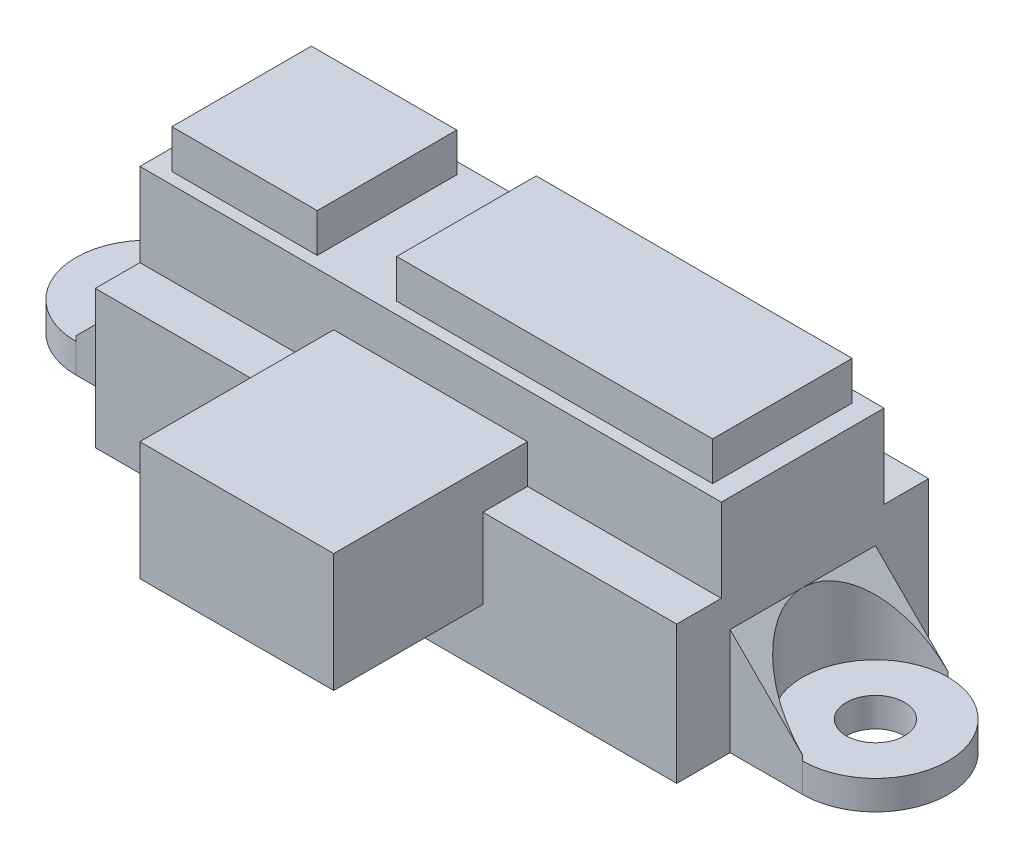
ISO-10303-21;
HEADER;
FILE_DESCRIPTION(('STEP AP214'),'2;1');
FILE_NAME('part.step','',(''),(''),'','','');
FILE_SCHEMA(('AUTOMOTIVE_DESIGN { 1 0 10303 214 1 1 1 1 }'));
ENDSEC;
DATA;
#1=APPLICATION_CONTEXT('core data for automotive mechanical design processes');
#2=APPLICATION_PROTOCOL_DEFINITION('international standard','automotive_design',2000,#1);
#3=PRODUCT_CONTEXT('',#1,'mechanical');
#4=PRODUCT('Part','Part','',(#3));
#5=PRODUCT_RELATED_PRODUCT_CATEGORY('part','',(#4));
#6=PRODUCT_DEFINITION_FORMATION('','',#4);
#7=PRODUCT_DEFINITION_CONTEXT('part definition',#1,'design');
#8=PRODUCT_DEFINITION('design','',#6,#7);
#9=PRODUCT_DEFINITION_SHAPE('','',#8);
#10=(LENGTH_UNIT() NAMED_UNIT(*) SI_UNIT(.MILLI.,.METRE.));
#11=(NAMED_UNIT(*) PLANE_ANGLE_UNIT() SI_UNIT($,.RADIAN.));
#12=(NAMED_UNIT(*) SI_UNIT($,.STERADIAN.) SOLID_ANGLE_UNIT());
#13=UNCERTAINTY_MEASURE_WITH_UNIT(LENGTH_MEASURE(1.E-05),#10,'distance_accuracy_value','');
#14=(GEOMETRIC_REPRESENTATION_CONTEXT(3) GLOBAL_UNCERTAINTY_ASSIGNED_CONTEXT((#13)) GLOBAL_UNIT_ASSIGNED_CONTEXT((#10,
#11,#12)) REPRESENTATION_CONTEXT('',''));
#15=CARTESIAN_POINT('',(0.,0.,0.));
#16=DIRECTION('',(0.,0.,1.));
#17=DIRECTION('',(1.,0.,0.));
#18=AXIS2_PLACEMENT_3D('',#15,#16,#17);
#19=CARTESIAN_POINT('',(0.,7.12,0.));
#20=DIRECTION('',(0.,1.,0.));
#21=DIRECTION('',(0.,0.,1.));
#22=AXIS2_PLACEMENT_3D('',#19,#20,#21);
#23=PLANE('',#22);
#24=DIRECTION('',(1.,0.,0.));
#25=VECTOR('',#24,1.);
#26=CARTESIAN_POINT('',(-15.,7.12,4.2));
#27=LINE('',#26,#25);
#28=CARTESIAN_POINT('',(5.,7.12,4.2));
#29=VERTEX_POINT('',#28);
#30=CARTESIAN_POINT('',(15.,7.12,4.2));
#31=VERTEX_POINT('',#30);
#32=EDGE_CURVE('E408',#29,#31,#27,.T.);
#33=ORIENTED_EDGE('',*,*,#32,.F.);
#34=DIRECTION('',(0.,0.,1.));
#35=VECTOR('',#34,1.);
#36=CARTESIAN_POINT('',(5.,7.12,0.));
#37=LINE('',#36,#35);
#38=CARTESIAN_POINT('',(5.,7.12,6.5));
#39=VERTEX_POINT('',#38);
#40=EDGE_CURVE('E288',#29,#39,#37,.T.);
#41=ORIENTED_EDGE('',*,*,#40,.T.);
#42=DIRECTION('',(1.,0.,0.));
#43=VECTOR('',#42,1.);
#44=CARTESIAN_POINT('',(-15.,7.12,6.5));
#45=LINE('',#44,#43);
#46=CARTESIAN_POINT('',(15.,7.12,6.5));
#47=VERTEX_POINT('',#46);
#48=EDGE_CURVE('E485',#39,#47,#45,.T.);
#49=ORIENTED_EDGE('',*,*,#48,.T.);
#50=DIRECTION('',(0.,0.,-1.));
#51=VECTOR('',#50,1.);
#52=CARTESIAN_POINT('',(15.,7.12,-6.5));
#53=LINE('',#52,#51);
#54=EDGE_CURVE('E476',#47,#31,#53,.T.);
#55=ORIENTED_EDGE('',*,*,#54,.T.);
#56=EDGE_LOOP('',(#33,#41,#49,#55));
#57=FACE_BOUND('',#56,.T.);
#58=ADVANCED_FACE('F40',(#57),#23,.T.);
#59=CARTESIAN_POINT('',(-15.,7.12,6.5));
#60=VERTEX_POINT('',#59);
#61=CARTESIAN_POINT('',(-5.,7.12,6.5));
#62=VERTEX_POINT('',#61);
#63=EDGE_CURVE('E486',#60,#62,#45,.T.);
#64=ORIENTED_EDGE('',*,*,#63,.T.);
#65=DIRECTION('',(0.,0.,-1.));
#66=VECTOR('',#65,1.);
#67=CARTESIAN_POINT('',(-5.,7.12,0.));
#68=LINE('',#67,#66);
#69=CARTESIAN_POINT('',(-5.,7.12,4.2));
#70=VERTEX_POINT('',#69);
#71=EDGE_CURVE('E279',#62,#70,#68,.T.);
#72=ORIENTED_EDGE('',*,*,#71,.T.);
#73=CARTESIAN_POINT('',(-15.,7.12,4.2));
#74=VERTEX_POINT('',#73);
#75=EDGE_CURVE('E399',#74,#70,#27,.T.);
#76=ORIENTED_EDGE('',*,*,#75,.F.);
#77=DIRECTION('',(0.,0.,1.));
#78=VECTOR('',#77,1.);
#79=CARTESIAN_POINT('',(-15.,7.12,-6.5));
#80=LINE('',#79,#78);
#81=EDGE_CURVE('E482',#74,#60,#80,.T.);
#82=ORIENTED_EDGE('',*,*,#81,.T.);
#83=EDGE_LOOP('',(#64,#72,#76,#82));
#84=FACE_BOUND('',#83,.T.);
#85=ADVANCED_FACE('F596',(#84),#23,.T.);
#86=CARTESIAN_POINT('',(-15.,7.12,6.5));
#87=DIRECTION('',(0.,0.,-1.));
#88=DIRECTION('',(-1.,0.,0.));
#89=AXIS2_PLACEMENT_3D('',#86,#87,#88);
#90=PLANE('',#89);
#91=DIRECTION('',(0.,1.,0.));
#92=VECTOR('',#91,1.);
#93=CARTESIAN_POINT('',(5.,7.12,6.5));
#94=LINE('',#93,#92);
#95=CARTESIAN_POINT('',(5.,3.,6.5));
#96=VERTEX_POINT('',#95);
#97=EDGE_CURVE('E55',#96,#39,#94,.T.);
#98=ORIENTED_EDGE('',*,*,#97,.F.);
#99=DIRECTION('',(1.,0.,0.));
#100=VECTOR('',#99,1.);
#101=CARTESIAN_POINT('',(-15.,3.,6.5));
#102=LINE('',#101,#100);
#103=CARTESIAN_POINT('',(-5.,3.,6.5));
#104=VERTEX_POINT('',#103);
#105=EDGE_CURVE('E11',#104,#96,#102,.T.);
#106=ORIENTED_EDGE('',*,*,#105,.F.);
#107=DIRECTION('',(0.,-1.,0.));
#108=VECTOR('',#107,1.);
#109=CARTESIAN_POINT('',(-5.,7.12,6.5));
#110=LINE('',#109,#108);
#111=EDGE_CURVE('E277',#62,#104,#110,.T.);
#112=ORIENTED_EDGE('',*,*,#111,.F.);
#113=ORIENTED_EDGE('',*,*,#63,.F.);
#114=DIRECTION('',(0.,-1.,0.));
#115=VECTOR('',#114,1.);
#116=CARTESIAN_POINT('',(-15.,7.12,6.5));
#117=LINE('',#116,#115);
#118=CARTESIAN_POINT('',(-15.,0.,6.5));
#119=VERTEX_POINT('',#118);
#120=EDGE_CURVE('E503',#60,#119,#117,.T.);
#121=ORIENTED_EDGE('',*,*,#120,.T.);
#122=DIRECTION('',(1.,0.,0.));
#123=VECTOR('',#122,1.);
#124=CARTESIAN_POINT('',(-15.,0.,6.5));
#125=LINE('',#124,#123);
#126=CARTESIAN_POINT('',(15.,0.,6.5));
#127=VERTEX_POINT('',#126);
#128=EDGE_CURVE('E499',#119,#127,#125,.T.);
#129=ORIENTED_EDGE('',*,*,#128,.T.);
#130=DIRECTION('',(0.,-1.,0.));
#131=VECTOR('',#130,1.);
#132=CARTESIAN_POINT('',(15.,7.12,6.5));
#133=LINE('',#132,#131);
#134=EDGE_CURVE('E489',#47,#127,#133,.T.);
#135=ORIENTED_EDGE('',*,*,#134,.F.);
#136=ORIENTED_EDGE('',*,*,#48,.F.);
#137=EDGE_LOOP('',(#98,#106,#112,#113,#121,#129,#135,#136));
#138=FACE_BOUND('',#137,.T.);
#139=ADVANCED_FACE('F601',(#138),#90,.F.);
#140=CARTESIAN_POINT('',(-15.,11.42,4.2));
#141=DIRECTION('',(0.,0.,-1.));
#142=DIRECTION('',(-1.,0.,0.));
#143=AXIS2_PLACEMENT_3D('',#140,#141,#142);
#144=PLANE('',#143);
#145=DIRECTION('',(0.,1.,0.));
#146=VECTOR('',#145,1.);
#147=CARTESIAN_POINT('',(5.,11.42,4.2));
#148=LINE('',#147,#146);
#149=CARTESIAN_POINT('',(5.,9.12,4.2));
#150=VERTEX_POINT('',#149);
#151=EDGE_CURVE('E48',#29,#150,#148,.T.);
#152=ORIENTED_EDGE('',*,*,#151,.F.);
#153=ORIENTED_EDGE('',*,*,#32,.T.);
#154=DIRECTION('',(0.,-1.,0.));
#155=VECTOR('',#154,1.);
#156=CARTESIAN_POINT('',(15.,11.42,4.2));
#157=LINE('',#156,#155);
#158=CARTESIAN_POINT('',(15.,11.42,4.2));
#159=VERTEX_POINT('',#158);
#160=EDGE_CURVE('E405',#159,#31,#157,.T.);
#161=ORIENTED_EDGE('',*,*,#160,.F.);
#162=DIRECTION('',(1.,0.,0.));
#163=VECTOR('',#162,1.);
#164=CARTESIAN_POINT('',(-15.,11.42,4.2));
#165=LINE('',#164,#163);
#166=CARTESIAN_POINT('',(-15.,11.42,4.2));
#167=VERTEX_POINT('',#166);
#168=EDGE_CURVE('E403',#167,#159,#165,.T.);
#169=ORIENTED_EDGE('',*,*,#168,.F.);
#170=DIRECTION('',(0.,-1.,0.));
#171=VECTOR('',#170,1.);
#172=CARTESIAN_POINT('',(-15.,11.42,4.2));
#173=LINE('',#172,#171);
#174=EDGE_CURVE('E412',#167,#74,#173,.T.);
#175=ORIENTED_EDGE('',*,*,#174,.T.);
#176=ORIENTED_EDGE('',*,*,#75,.T.);
#177=DIRECTION('',(0.,-1.,0.));
#178=VECTOR('',#177,1.);
#179=CARTESIAN_POINT('',(-5.,9.12,4.2));
#180=LINE('',#179,#178);
#181=CARTESIAN_POINT('',(-5.,9.12,4.2));
#182=VERTEX_POINT('',#181);
#183=EDGE_CURVE('E272',#182,#70,#180,.T.);
#184=ORIENTED_EDGE('',*,*,#183,.F.);
#185=DIRECTION('',(-1.,0.,0.));
#186=VECTOR('',#185,1.);
#187=CARTESIAN_POINT('',(-5.,9.12,4.2));
#188=LINE('',#187,#186);
#189=EDGE_CURVE('E680',#150,#182,#188,.T.);
#190=ORIENTED_EDGE('',*,*,#189,.F.);
#191=EDGE_LOOP('',(#152,#153,#161,#169,#175,#176,#184,#190));
#192=FACE_BOUND('',#191,.T.);
#193=ADVANCED_FACE('F550',(#192),#144,.F.);
#194=CARTESIAN_POINT('',(15.,7.12,-6.5));
#195=DIRECTION('',(-1.,0.,0.));
#196=DIRECTION('',(0.,0.,1.));
#197=AXIS2_PLACEMENT_3D('',#194,#195,#196);
#198=PLANE('',#197);
#199=DIRECTION('',(0.,-1.,0.));
#200=VECTOR('',#199,1.);
#201=CARTESIAN_POINT('',(15.,1.5,3.75));
#202=LINE('',#201,#200);
#203=CARTESIAN_POINT('',(15.,5.5,3.75));
#204=VERTEX_POINT('',#203);
#205=CARTESIAN_POINT('',(15.,0.,3.75));
#206=VERTEX_POINT('',#205);
#207=EDGE_CURVE('E473',#204,#206,#202,.T.);
#208=ORIENTED_EDGE('',*,*,#207,.F.);
#209=DIRECTION('',(0.,0.,1.));
#210=VECTOR('',#209,1.);
#211=CARTESIAN_POINT('',(15.,5.5,0.));
#212=LINE('',#211,#210);
#213=CARTESIAN_POINT('',(15.,5.5,0.));
#214=VERTEX_POINT('',#213);
#215=EDGE_CURVE('E308',#214,#204,#212,.T.);
#216=ORIENTED_EDGE('',*,*,#215,.F.);
#217=DIRECTION('',(0.,0.,1.));
#218=VECTOR('',#217,1.);
#219=CARTESIAN_POINT('',(15.,5.5,0.));
#220=LINE('',#219,#218);
#221=CARTESIAN_POINT('',(15.,5.5,-3.75));
#222=VERTEX_POINT('',#221);
#223=EDGE_CURVE('E311',#222,#214,#220,.T.);
#224=ORIENTED_EDGE('',*,*,#223,.F.);
#225=DIRECTION('',(0.,-1.,0.));
#226=VECTOR('',#225,1.);
#227=CARTESIAN_POINT('',(15.,1.5,-3.75));
#228=LINE('',#227,#226);
#229=CARTESIAN_POINT('',(15.,0.,-3.75));
#230=VERTEX_POINT('',#229);
#231=EDGE_CURVE('E470',#222,#230,#228,.T.);
#232=ORIENTED_EDGE('',*,*,#231,.T.);
#233=DIRECTION('',(0.,0.,-1.));
#234=VECTOR('',#233,1.);
#235=CARTESIAN_POINT('',(15.,0.,-6.5));
#236=LINE('',#235,#234);
#237=CARTESIAN_POINT('',(15.,0.,-6.5));
#238=VERTEX_POINT('',#237);
#239=EDGE_CURVE('E469',#230,#238,#236,.T.);
#240=ORIENTED_EDGE('',*,*,#239,.T.);
#241=DIRECTION('',(0.,-1.,0.));
#242=VECTOR('',#241,1.);
#243=CARTESIAN_POINT('',(15.,7.12,-6.5));
#244=LINE('',#243,#242);
#245=CARTESIAN_POINT('',(15.,7.12,-6.5));
#246=VERTEX_POINT('',#245);
#247=EDGE_CURVE('E509',#246,#238,#244,.T.);
#248=ORIENTED_EDGE('',*,*,#247,.F.);
#249=CARTESIAN_POINT('',(15.,7.12,-4.2));
#250=VERTEX_POINT('',#249);
#251=EDGE_CURVE('E480',#250,#246,#53,.T.);
#252=ORIENTED_EDGE('',*,*,#251,.F.);
#253=DIRECTION('',(0.,-1.,0.));
#254=VECTOR('',#253,1.);
#255=CARTESIAN_POINT('',(15.,11.42,-4.2));
#256=LINE('',#255,#254);
#257=CARTESIAN_POINT('',(15.,11.42,-4.2));
#258=VERTEX_POINT('',#257);
#259=EDGE_CURVE('E418',#258,#250,#256,.T.);
#260=ORIENTED_EDGE('',*,*,#259,.F.);
#261=DIRECTION('',(0.,0.,-1.));
#262=VECTOR('',#261,1.);
#263=CARTESIAN_POINT('',(15.,11.42,4.2));
#264=LINE('',#263,#262);
#265=EDGE_CURVE('E395',#159,#258,#264,.T.);
#266=ORIENTED_EDGE('',*,*,#265,.F.);
#267=ORIENTED_EDGE('',*,*,#160,.T.);
#268=ORIENTED_EDGE('',*,*,#54,.F.);
#269=ORIENTED_EDGE('',*,*,#134,.T.);
#270=EDGE_CURVE('E490',#127,#206,#236,.T.);
#271=ORIENTED_EDGE('',*,*,#270,.T.);
#272=EDGE_LOOP('',(#208,#216,#224,#232,#240,#248,#252,#260,#266,#267,#268,#269,#271));
#273=FACE_BOUND('',#272,.T.);
#274=ADVANCED_FACE('F42',(#273),#198,.F.);
#275=CARTESIAN_POINT('',(-15.,7.12,-6.5));
#276=DIRECTION('',(1.,0.,0.));
#277=DIRECTION('',(0.,0.,-1.));
#278=AXIS2_PLACEMENT_3D('',#275,#276,#277);
#279=PLANE('',#278);
#280=DIRECTION('',(0.,-1.,0.));
#281=VECTOR('',#280,1.);
#282=CARTESIAN_POINT('',(-15.,1.5,-3.75));
#283=LINE('',#282,#281);
#284=CARTESIAN_POINT('',(-15.,5.5,-3.75));
#285=VERTEX_POINT('',#284);
#286=CARTESIAN_POINT('',(-15.,0.,-3.75));
#287=VERTEX_POINT('',#286);
#288=EDGE_CURVE('E431',#285,#287,#283,.T.);
#289=ORIENTED_EDGE('',*,*,#288,.F.);
#290=DIRECTION('',(0.,0.,-1.));
#291=VECTOR('',#290,1.);
#292=CARTESIAN_POINT('',(-15.,5.5,0.));
#293=LINE('',#292,#291);
#294=CARTESIAN_POINT('',(-15.,5.5,0.));
#295=VERTEX_POINT('',#294);
#296=EDGE_CURVE('E319',#295,#285,#293,.T.);
#297=ORIENTED_EDGE('',*,*,#296,.F.);
#298=DIRECTION('',(0.,0.,-1.));
#299=VECTOR('',#298,1.);
#300=CARTESIAN_POINT('',(-15.,5.5,0.));
#301=LINE('',#300,#299);
#302=CARTESIAN_POINT('',(-15.,5.5,3.75));
#303=VERTEX_POINT('',#302);
#304=EDGE_CURVE('E322',#303,#295,#301,.T.);
#305=ORIENTED_EDGE('',*,*,#304,.F.);
#306=DIRECTION('',(0.,-1.,0.));
#307=VECTOR('',#306,1.);
#308=CARTESIAN_POINT('',(-15.,1.5,3.75));
#309=LINE('',#308,#307);
#310=CARTESIAN_POINT('',(-15.,0.,3.75));
#311=VERTEX_POINT('',#310);
#312=EDGE_CURVE('E445',#303,#311,#309,.T.);
#313=ORIENTED_EDGE('',*,*,#312,.T.);
#314=DIRECTION('',(0.,0.,1.));
#315=VECTOR('',#314,1.);
#316=CARTESIAN_POINT('',(-15.,0.,-6.5));
#317=LINE('',#316,#315);
#318=EDGE_CURVE('E495',#311,#119,#317,.T.);
#319=ORIENTED_EDGE('',*,*,#318,.T.);
#320=ORIENTED_EDGE('',*,*,#120,.F.);
#321=ORIENTED_EDGE('',*,*,#81,.F.);
#322=ORIENTED_EDGE('',*,*,#174,.F.);
#323=DIRECTION('',(0.,0.,1.));
#324=VECTOR('',#323,1.);
#325=CARTESIAN_POINT('',(-15.,11.42,4.2));
#326=LINE('',#325,#324);
#327=CARTESIAN_POINT('',(-15.,11.42,-4.2));
#328=VERTEX_POINT('',#327);
#329=EDGE_CURVE('E401',#328,#167,#326,.T.);
#330=ORIENTED_EDGE('',*,*,#329,.F.);
#331=DIRECTION('',(0.,-1.,0.));
#332=VECTOR('',#331,1.);
#333=CARTESIAN_POINT('',(-15.,11.42,-4.2));
#334=LINE('',#333,#332);
#335=CARTESIAN_POINT('',(-15.,7.12,-4.2));
#336=VERTEX_POINT('',#335);
#337=EDGE_CURVE('E415',#328,#336,#334,.T.);
#338=ORIENTED_EDGE('',*,*,#337,.T.);
#339=CARTESIAN_POINT('',(-15.,7.12,-6.5));
#340=VERTEX_POINT('',#339);
#341=EDGE_CURVE('E483',#340,#336,#80,.T.);
#342=ORIENTED_EDGE('',*,*,#341,.F.);
#343=DIRECTION('',(0.,-1.,0.));
#344=VECTOR('',#343,1.);
#345=CARTESIAN_POINT('',(-15.,7.12,-6.5));
#346=LINE('',#345,#344);
#347=CARTESIAN_POINT('',(-15.,0.,-6.5));
#348=VERTEX_POINT('',#347);
#349=EDGE_CURVE('E506',#340,#348,#346,.T.);
#350=ORIENTED_EDGE('',*,*,#349,.T.);
#351=EDGE_CURVE('E496',#348,#287,#317,.T.);
#352=ORIENTED_EDGE('',*,*,#351,.T.);
#353=EDGE_LOOP('',(#289,#297,#305,#313,#319,#320,#321,#322,#330,#338,#342,#350,#352));
#354=FACE_BOUND('',#353,.T.);
#355=ADVANCED_FACE('F532',(#354),#279,.F.);
#356=CARTESIAN_POINT('',(0.,11.42,0.));
#357=DIRECTION('',(0.,-1.,0.));
#358=DIRECTION('',(0.,0.,-1.));
#359=AXIS2_PLACEMENT_3D('',#356,#357,#358);
#360=PLANE('',#359);
#361=DIRECTION('',(0.,0.,1.));
#362=VECTOR('',#361,1.);
#363=CARTESIAN_POINT('',(-13.95,11.42,3.6));
#364=LINE('',#363,#362);
#365=CARTESIAN_POINT('',(-13.95,11.42,-3.6));
#366=VERTEX_POINT('',#365);
#367=CARTESIAN_POINT('',(-13.95,11.42,3.6));
#368=VERTEX_POINT('',#367);
#369=EDGE_CURVE('E361',#366,#368,#364,.T.);
#370=ORIENTED_EDGE('',*,*,#369,.F.);
#371=DIRECTION('',(-1.,0.,0.));
#372=VECTOR('',#371,1.);
#373=CARTESIAN_POINT('',(-6.45,11.42,-3.6));
#374=LINE('',#373,#372);
#375=CARTESIAN_POINT('',(-6.45,11.42,-3.6));
#376=VERTEX_POINT('',#375);
#377=EDGE_CURVE('E366',#376,#366,#374,.T.);
#378=ORIENTED_EDGE('',*,*,#377,.F.);
#379=DIRECTION('',(0.,0.,-1.));
#380=VECTOR('',#379,1.);
#381=CARTESIAN_POINT('',(-6.45,11.42,3.6));
#382=LINE('',#381,#380);
#383=CARTESIAN_POINT('',(-6.45,11.42,3.6));
#384=VERTEX_POINT('',#383);
#385=EDGE_CURVE('E378',#384,#376,#382,.T.);
#386=ORIENTED_EDGE('',*,*,#385,.F.);
#387=DIRECTION('',(1.,0.,0.));
#388=VECTOR('',#387,1.);
#389=CARTESIAN_POINT('',(-6.45,11.42,3.6));
#390=LINE('',#389,#388);
#391=EDGE_CURVE('E375',#368,#384,#390,.T.);
#392=ORIENTED_EDGE('',*,*,#391,.F.);
#393=EDGE_LOOP('',(#370,#378,#386,#392));
#394=FACE_BOUND('',#393,.T.);
#395=ORIENTED_EDGE('',*,*,#265,.T.);
#396=DIRECTION('',(-1.,0.,0.));
#397=VECTOR('',#396,1.);
#398=CARTESIAN_POINT('',(-15.,11.42,-4.2));
#399=LINE('',#398,#397);
#400=EDGE_CURVE('E398',#258,#328,#399,.T.);
#401=ORIENTED_EDGE('',*,*,#400,.T.);
#402=ORIENTED_EDGE('',*,*,#329,.T.);
#403=ORIENTED_EDGE('',*,*,#168,.T.);
#404=EDGE_LOOP('',(#395,#401,#402,#403));
#405=FACE_BOUND('',#404,.T.);
#406=DIRECTION('',(0.,0.,-1.));
#407=VECTOR('',#406,1.);
#408=CARTESIAN_POINT('',(13.95,11.42,3.6));
#409=LINE('',#408,#407);
#410=CARTESIAN_POINT('',(13.95,11.42,3.6));
#411=VERTEX_POINT('',#410);
#412=CARTESIAN_POINT('',(13.95,11.42,-3.6));
#413=VERTEX_POINT('',#412);
#414=EDGE_CURVE('E328',#411,#413,#409,.T.);
#415=ORIENTED_EDGE('',*,*,#414,.F.);
#416=DIRECTION('',(1.,0.,0.));
#417=VECTOR('',#416,1.);
#418=CARTESIAN_POINT('',(-2.35,11.42,3.6));
#419=LINE('',#418,#417);
#420=CARTESIAN_POINT('',(-2.35,11.42,3.6));
#421=VERTEX_POINT('',#420);
#422=EDGE_CURVE('E333',#421,#411,#419,.T.);
#423=ORIENTED_EDGE('',*,*,#422,.F.);
#424=DIRECTION('',(0.,0.,1.));
#425=VECTOR('',#424,1.);
#426=CARTESIAN_POINT('',(-2.35,11.42,3.6));
#427=LINE('',#426,#425);
#428=CARTESIAN_POINT('',(-2.35,11.42,-3.6));
#429=VERTEX_POINT('',#428);
#430=EDGE_CURVE('E345',#429,#421,#427,.T.);
#431=ORIENTED_EDGE('',*,*,#430,.F.);
#432=DIRECTION('',(-1.,0.,0.));
#433=VECTOR('',#432,1.);
#434=CARTESIAN_POINT('',(-2.35,11.42,-3.6));
#435=LINE('',#434,#433);
#436=EDGE_CURVE('E342',#413,#429,#435,.T.);
#437=ORIENTED_EDGE('',*,*,#436,.F.);
#438=EDGE_LOOP('',(#415,#423,#431,#437));
#439=FACE_BOUND('',#438,.T.);
#440=ADVANCED_FACE('F545',(#394,#405,#439),#360,.F.);
#441=CARTESIAN_POINT('',(-15.,7.12,-6.5));
#442=DIRECTION('',(0.,0.,1.));
#443=DIRECTION('',(1.,0.,0.));
#444=AXIS2_PLACEMENT_3D('',#441,#442,#443);
#445=PLANE('',#444);
#446=DIRECTION('',(-1.,0.,0.));
#447=VECTOR('',#446,1.);
#448=CARTESIAN_POINT('',(-15.,0.,-6.5));
#449=LINE('',#448,#447);
#450=EDGE_CURVE('E493',#238,#348,#449,.T.);
#451=ORIENTED_EDGE('',*,*,#450,.T.);
#452=ORIENTED_EDGE('',*,*,#349,.F.);
#453=DIRECTION('',(-1.,0.,0.));
#454=VECTOR('',#453,1.);
#455=CARTESIAN_POINT('',(-15.,7.12,-6.5));
#456=LINE('',#455,#454);
#457=EDGE_CURVE('E479',#246,#340,#456,.T.);
#458=ORIENTED_EDGE('',*,*,#457,.F.);
#459=ORIENTED_EDGE('',*,*,#247,.T.);
#460=EDGE_LOOP('',(#451,#452,#458,#459));
#461=FACE_BOUND('',#460,.T.);
#462=ADVANCED_FACE('F514',(#461),#445,.F.);
#463=DIRECTION('',(-1.,0.,0.));
#464=VECTOR('',#463,1.);
#465=CARTESIAN_POINT('',(-15.,7.12,-4.2));
#466=LINE('',#465,#464);
#467=EDGE_CURVE('E394',#250,#336,#466,.T.);
#468=ORIENTED_EDGE('',*,*,#467,.F.);
#469=ORIENTED_EDGE('',*,*,#251,.T.);
#470=ORIENTED_EDGE('',*,*,#457,.T.);
#471=ORIENTED_EDGE('',*,*,#341,.T.);
#472=EDGE_LOOP('',(#468,#469,#470,#471));
#473=FACE_BOUND('',#472,.T.);
#474=ADVANCED_FACE('F538',(#473),#23,.T.);
#475=CARTESIAN_POINT('',(0.,0.,0.));
#476=DIRECTION('',(0.,1.,0.));
#477=DIRECTION('',(0.,0.,1.));
#478=AXIS2_PLACEMENT_3D('',#475,#476,#477);
#479=PLANE('',#478);
#480=ORIENTED_EDGE('',*,*,#270,.F.);
#481=ORIENTED_EDGE('',*,*,#128,.F.);
#482=ORIENTED_EDGE('',*,*,#318,.F.);
#483=DIRECTION('',(-1.,0.,0.));
#484=VECTOR('',#483,1.);
#485=CARTESIAN_POINT('',(-18.75,0.,3.75));
#486=LINE('',#485,#484);
#487=CARTESIAN_POINT('',(-18.75,0.,3.75));
#488=VERTEX_POINT('',#487);
#489=EDGE_CURVE('E435',#311,#488,#486,.T.);
#490=ORIENTED_EDGE('',*,*,#489,.T.);
#491=CARTESIAN_POINT('',(-18.75,0.,0.));
#492=DIRECTION('',(0.,-1.,0.));
#493=DIRECTION('',(0.,0.,-1.));
#494=AXIS2_PLACEMENT_3D('',#491,#492,#493);
#495=CIRCLE('',#494,3.75);
#496=CARTESIAN_POINT('',(-18.75,0.,-3.75));
#497=VERTEX_POINT('',#496);
#498=EDGE_CURVE('E432',#488,#497,#495,.T.);
#499=ORIENTED_EDGE('',*,*,#498,.T.);
#500=DIRECTION('',(1.,0.,0.));
#501=VECTOR('',#500,1.);
#502=CARTESIAN_POINT('',(-15.,0.,-3.75));
#503=LINE('',#502,#501);
#504=EDGE_CURVE('E425',#497,#287,#503,.T.);
#505=ORIENTED_EDGE('',*,*,#504,.T.);
#506=ORIENTED_EDGE('',*,*,#351,.F.);
#507=ORIENTED_EDGE('',*,*,#450,.F.);
#508=ORIENTED_EDGE('',*,*,#239,.F.);
#509=DIRECTION('',(1.,0.,0.));
#510=VECTOR('',#509,1.);
#511=CARTESIAN_POINT('',(18.75,0.,-3.75));
#512=LINE('',#511,#510);
#513=CARTESIAN_POINT('',(18.75,0.,-3.75));
#514=VERTEX_POINT('',#513);
#515=EDGE_CURVE('E459',#230,#514,#512,.T.);
#516=ORIENTED_EDGE('',*,*,#515,.T.);
#517=CARTESIAN_POINT('',(18.75,0.,0.));
#518=DIRECTION('',(0.,-1.,0.));
#519=DIRECTION('',(0.,0.,-1.));
#520=AXIS2_PLACEMENT_3D('',#517,#518,#519);
#521=CIRCLE('',#520,3.75);
#522=CARTESIAN_POINT('',(18.75,0.,3.75));
#523=VERTEX_POINT('',#522);
#524=EDGE_CURVE('E452',#514,#523,#521,.T.);
#525=ORIENTED_EDGE('',*,*,#524,.T.);
#526=DIRECTION('',(-1.,0.,0.));
#527=VECTOR('',#526,1.);
#528=CARTESIAN_POINT('',(18.75,0.,3.75));
#529=LINE('',#528,#527);
#530=EDGE_CURVE('E462',#523,#206,#529,.T.);
#531=ORIENTED_EDGE('',*,*,#530,.T.);
#532=EDGE_LOOP('',(#480,#481,#482,#490,#499,#505,#506,#507,#508,#516,#525,#531));
#533=FACE_BOUND('',#532,.T.);
#534=CARTESIAN_POINT('',(18.75,0.,0.));
#535=DIRECTION('',(0.,-1.,0.));
#536=DIRECTION('',(0.,0.,-1.));
#537=AXIS2_PLACEMENT_3D('',#534,#535,#536);
#538=CIRCLE('',#537,1.5);
#539=CARTESIAN_POINT('',(18.75,0.,-1.5));
#540=VERTEX_POINT('',#539);
#541=EDGE_CURVE('E442',#540,#540,#538,.T.);
#542=ORIENTED_EDGE('',*,*,#541,.F.);
#543=EDGE_LOOP('',(#542));
#544=FACE_BOUND('',#543,.T.);
#545=CARTESIAN_POINT('',(-18.75,0.,0.));
#546=DIRECTION('',(0.,-1.,0.));
#547=DIRECTION('',(0.,0.,-1.));
#548=AXIS2_PLACEMENT_3D('',#545,#546,#547);
#549=CIRCLE('',#548,1.5);
#550=CARTESIAN_POINT('',(-18.75,0.,-1.5));
#551=VERTEX_POINT('',#550);
#552=EDGE_CURVE('E421',#551,#551,#549,.T.);
#553=ORIENTED_EDGE('',*,*,#552,.F.);
#554=EDGE_LOOP('',(#553));
#555=FACE_BOUND('',#554,.T.);
#556=ADVANCED_FACE('F527',(#533,#544,#555),#479,.F.);
#557=CARTESIAN_POINT('',(18.75,1.5,0.));
#558=DIRECTION('',(0.,-1.,0.));
#559=DIRECTION('',(0.,0.,-1.));
#560=AXIS2_PLACEMENT_3D('',#557,#558,#559);
#561=CYLINDRICAL_SURFACE('',#560,3.75);
#562=ORIENTED_EDGE('',*,*,#524,.F.);
#563=DIRECTION('',(0.,-1.,0.));
#564=VECTOR('',#563,1.);
#565=CARTESIAN_POINT('',(18.75,1.5,-3.75));
#566=LINE('',#565,#564);
#567=CARTESIAN_POINT('',(18.75,1.5,-3.75));
#568=VERTEX_POINT('',#567);
#569=EDGE_CURVE('E467',#568,#514,#566,.T.);
#570=ORIENTED_EDGE('',*,*,#569,.F.);
#571=CARTESIAN_POINT('',(18.75,1.5,0.));
#572=DIRECTION('',(0.,-1.,0.));
#573=DIRECTION('',(0.,0.,-1.));
#574=AXIS2_PLACEMENT_3D('',#571,#572,#573);
#575=CIRCLE('',#574,3.75);
#576=CARTESIAN_POINT('',(18.75,1.5,3.75));
#577=VERTEX_POINT('',#576);
#578=EDGE_CURVE('E455',#568,#577,#575,.T.);
#579=ORIENTED_EDGE('',*,*,#578,.T.);
#580=DIRECTION('',(0.,-1.,0.));
#581=VECTOR('',#580,1.);
#582=CARTESIAN_POINT('',(18.75,1.5,3.75));
#583=LINE('',#582,#581);
#584=EDGE_CURVE('E458',#577,#523,#583,.T.);
#585=ORIENTED_EDGE('',*,*,#584,.T.);
#586=EDGE_LOOP('',(#562,#570,#579,#585));
#587=FACE_BOUND('',#586,.T.);
#588=ADVANCED_FACE('F579',(#587),#561,.T.);
#589=CARTESIAN_POINT('',(18.75,1.5,-3.75));
#590=DIRECTION('',(0.,0.,-1.));
#591=DIRECTION('',(-1.,0.,0.));
#592=AXIS2_PLACEMENT_3D('',#589,#590,#591);
#593=PLANE('',#592);
#594=DIRECTION('',(0.707106781186552,-0.707106781186544,0.));
#595=VECTOR('',#594,1.);
#596=CARTESIAN_POINT('',(15.,5.5,-3.75));
#597=LINE('',#596,#595);
#598=CARTESIAN_POINT('',(18.75,1.75000000000004,-3.75));
#599=VERTEX_POINT('',#598);
#600=EDGE_CURVE('E294',#222,#599,#597,.T.);
#601=ORIENTED_EDGE('',*,*,#600,.T.);
#602=DIRECTION('',(0.,-1.,0.));
#603=VECTOR('',#602,1.);
#604=CARTESIAN_POINT('',(18.75,5.5,-3.75));
#605=LINE('',#604,#603);
#606=EDGE_CURVE('E313',#599,#568,#605,.T.);
#607=ORIENTED_EDGE('',*,*,#606,.T.);
#608=ORIENTED_EDGE('',*,*,#569,.T.);
#609=ORIENTED_EDGE('',*,*,#515,.F.);
#610=ORIENTED_EDGE('',*,*,#231,.F.);
#611=EDGE_LOOP('',(#601,#607,#608,#609,#610));
#612=FACE_BOUND('',#611,.T.);
#613=ADVANCED_FACE('F575',(#612),#593,.T.);
#614=CARTESIAN_POINT('',(18.75,1.5,3.75));
#615=DIRECTION('',(0.,0.,1.));
#616=DIRECTION('',(1.,0.,0.));
#617=AXIS2_PLACEMENT_3D('',#614,#615,#616);
#618=PLANE('',#617);
#619=DIRECTION('',(0.707106781186551,-0.707106781186543,0.));
#620=VECTOR('',#619,1.);
#621=CARTESIAN_POINT('',(15.,5.5,3.75));
#622=LINE('',#621,#620);
#623=CARTESIAN_POINT('',(18.75,1.75000000000004,3.75));
#624=VERTEX_POINT('',#623);
#625=EDGE_CURVE('E290',#204,#624,#622,.T.);
#626=ORIENTED_EDGE('',*,*,#625,.F.);
#627=ORIENTED_EDGE('',*,*,#207,.T.);
#628=ORIENTED_EDGE('',*,*,#530,.F.);
#629=ORIENTED_EDGE('',*,*,#584,.F.);
#630=DIRECTION('',(0.,-1.,0.));
#631=VECTOR('',#630,1.);
#632=CARTESIAN_POINT('',(18.75,5.5,3.75));
#633=LINE('',#632,#631);
#634=EDGE_CURVE('E306',#624,#577,#633,.T.);
#635=ORIENTED_EDGE('',*,*,#634,.F.);
#636=EDGE_LOOP('',(#626,#627,#628,#629,#635));
#637=FACE_BOUND('',#636,.T.);
#638=ADVANCED_FACE('F561',(#637),#618,.T.);
#639=CARTESIAN_POINT('',(18.75,1.5,0.));
#640=DIRECTION('',(0.,-1.,0.));
#641=DIRECTION('',(0.,0.,-1.));
#642=AXIS2_PLACEMENT_3D('',#639,#640,#641);
#643=PLANE('',#642);
#644=CARTESIAN_POINT('',(18.75,1.5,0.));
#645=DIRECTION('',(0.,-1.,0.));
#646=DIRECTION('',(0.,0.,-1.));
#647=AXIS2_PLACEMENT_3D('',#644,#645,#646);
#648=CIRCLE('',#647,1.5);
#649=CARTESIAN_POINT('',(18.75,1.5,-1.5));
#650=VERTEX_POINT('',#649);
#651=EDGE_CURVE('E449',#650,#650,#648,.T.);
#652=ORIENTED_EDGE('',*,*,#651,.T.);
#653=EDGE_LOOP('',(#652));
#654=FACE_BOUND('',#653,.T.);
#655=CARTESIAN_POINT('',(18.75,1.5,0.));
#656=DIRECTION('',(0.,1.,0.));
#657=DIRECTION('',(0.,0.,1.));
#658=AXIS2_PLACEMENT_3D('',#655,#656,#657);
#659=CIRCLE('',#658,3.75);
#660=EDGE_CURVE('E310',#568,#577,#659,.T.);
#661=ORIENTED_EDGE('',*,*,#660,.T.);
#662=ORIENTED_EDGE('',*,*,#578,.F.);
#663=EDGE_LOOP('',(#661,#662));
#664=FACE_BOUND('',#663,.T.);
#665=ADVANCED_FACE('F581',(#654,#664),#643,.F.);
#666=CARTESIAN_POINT('',(18.75,1.5,0.));
#667=DIRECTION('',(0.,-1.,0.));
#668=DIRECTION('',(0.,0.,-1.));
#669=AXIS2_PLACEMENT_3D('',#666,#667,#668);
#670=CYLINDRICAL_SURFACE('',#669,1.5);
#671=ORIENTED_EDGE('',*,*,#651,.F.);
#672=EDGE_LOOP('',(#671));
#673=FACE_BOUND('',#672,.T.);
#674=ORIENTED_EDGE('',*,*,#541,.T.);
#675=EDGE_LOOP('',(#674));
#676=FACE_BOUND('',#675,.T.);
#677=ADVANCED_FACE('F583',(#673,#676),#670,.F.);
#678=CARTESIAN_POINT('',(-15.,1.5,-3.75));
#679=DIRECTION('',(0.,0.,-1.));
#680=DIRECTION('',(-1.,0.,0.));
#681=AXIS2_PLACEMENT_3D('',#678,#679,#680);
#682=PLANE('',#681);
#683=DIRECTION('',(0.707106781186551,0.707106781186544,0.));
#684=VECTOR('',#683,1.);
#685=CARTESIAN_POINT('',(-15.,5.5,-3.75));
#686=LINE('',#685,#684);
#687=CARTESIAN_POINT('',(-18.75,1.75000000000004,-3.75));
#688=VERTEX_POINT('',#687);
#689=EDGE_CURVE('E293',#688,#285,#686,.T.);
#690=ORIENTED_EDGE('',*,*,#689,.T.);
#691=ORIENTED_EDGE('',*,*,#288,.T.);
#692=ORIENTED_EDGE('',*,*,#504,.F.);
#693=DIRECTION('',(0.,-1.,0.));
#694=VECTOR('',#693,1.);
#695=CARTESIAN_POINT('',(-18.75,1.5,-3.75));
#696=LINE('',#695,#694);
#697=CARTESIAN_POINT('',(-18.75,1.5,-3.75));
#698=VERTEX_POINT('',#697);
#699=EDGE_CURVE('E440',#698,#497,#696,.T.);
#700=ORIENTED_EDGE('',*,*,#699,.F.);
#701=DIRECTION('',(0.,-1.,0.));
#702=VECTOR('',#701,1.);
#703=CARTESIAN_POINT('',(-18.75,5.5,-3.75));
#704=LINE('',#703,#702);
#705=EDGE_CURVE('E317',#688,#698,#704,.T.);
#706=ORIENTED_EDGE('',*,*,#705,.F.);
#707=EDGE_LOOP('',(#690,#691,#692,#700,#706));
#708=FACE_BOUND('',#707,.T.);
#709=ADVANCED_FACE('F590',(#708),#682,.T.);
#710=CARTESIAN_POINT('',(-18.75,1.5,0.));
#711=DIRECTION('',(0.,-1.,0.));
#712=DIRECTION('',(0.,0.,-1.));
#713=AXIS2_PLACEMENT_3D('',#710,#711,#712);
#714=CYLINDRICAL_SURFACE('',#713,3.75);
#715=ORIENTED_EDGE('',*,*,#498,.F.);
#716=DIRECTION('',(0.,-1.,0.));
#717=VECTOR('',#716,1.);
#718=CARTESIAN_POINT('',(-18.75,1.5,3.75));
#719=LINE('',#718,#717);
#720=CARTESIAN_POINT('',(-18.75,1.5,3.75));
#721=VERTEX_POINT('',#720);
#722=EDGE_CURVE('E443',#721,#488,#719,.T.);
#723=ORIENTED_EDGE('',*,*,#722,.F.);
#724=CARTESIAN_POINT('',(-18.75,1.5,0.));
#725=DIRECTION('',(0.,-1.,0.));
#726=DIRECTION('',(0.,0.,-1.));
#727=AXIS2_PLACEMENT_3D('',#724,#725,#726);
#728=CIRCLE('',#727,3.75);
#729=EDGE_CURVE('E428',#721,#698,#728,.T.);
#730=ORIENTED_EDGE('',*,*,#729,.T.);
#731=ORIENTED_EDGE('',*,*,#699,.T.);
#732=EDGE_LOOP('',(#715,#723,#730,#731));
#733=FACE_BOUND('',#732,.T.);
#734=ADVANCED_FACE('F640',(#733),#714,.T.);
#735=CARTESIAN_POINT('',(-18.75,1.5,3.75));
#736=DIRECTION('',(0.,0.,1.));
#737=DIRECTION('',(1.,0.,0.));
#738=AXIS2_PLACEMENT_3D('',#735,#736,#737);
#739=PLANE('',#738);
#740=DIRECTION('',(0.707106781186551,0.707106781186544,0.));
#741=VECTOR('',#740,1.);
#742=CARTESIAN_POINT('',(-15.,5.5,3.75));
#743=LINE('',#742,#741);
#744=CARTESIAN_POINT('',(-18.75,1.75000000000004,3.75));
#745=VERTEX_POINT('',#744);
#746=EDGE_CURVE('E291',#745,#303,#743,.T.);
#747=ORIENTED_EDGE('',*,*,#746,.F.);
#748=DIRECTION('',(0.,-1.,0.));
#749=VECTOR('',#748,1.);
#750=CARTESIAN_POINT('',(-18.75,5.5,3.75));
#751=LINE('',#750,#749);
#752=EDGE_CURVE('E324',#745,#721,#751,.T.);
#753=ORIENTED_EDGE('',*,*,#752,.T.);
#754=ORIENTED_EDGE('',*,*,#722,.T.);
#755=ORIENTED_EDGE('',*,*,#489,.F.);
#756=ORIENTED_EDGE('',*,*,#312,.F.);
#757=EDGE_LOOP('',(#747,#753,#754,#755,#756));
#758=FACE_BOUND('',#757,.T.);
#759=ADVANCED_FACE('F638',(#758),#739,.T.);
#760=CARTESIAN_POINT('',(-18.75,1.5,0.));
#761=DIRECTION('',(0.,-1.,0.));
#762=DIRECTION('',(0.,0.,-1.));
#763=AXIS2_PLACEMENT_3D('',#760,#761,#762);
#764=PLANE('',#763);
#765=CARTESIAN_POINT('',(-18.75,1.5,0.));
#766=DIRECTION('',(0.,-1.,0.));
#767=DIRECTION('',(0.,0.,-1.));
#768=AXIS2_PLACEMENT_3D('',#765,#766,#767);
#769=CIRCLE('',#768,1.5);
#770=CARTESIAN_POINT('',(-18.75,1.5,-1.5));
#771=VERTEX_POINT('',#770);
#772=EDGE_CURVE('E422',#771,#771,#769,.T.);
#773=ORIENTED_EDGE('',*,*,#772,.T.);
#774=EDGE_LOOP('',(#773));
#775=FACE_BOUND('',#774,.T.);
#776=CARTESIAN_POINT('',(-18.75,1.5,0.));
#777=DIRECTION('',(0.,1.,0.));
#778=DIRECTION('',(0.,0.,1.));
#779=AXIS2_PLACEMENT_3D('',#776,#777,#778);
#780=CIRCLE('',#779,3.75);
#781=EDGE_CURVE('E321',#721,#698,#780,.T.);
#782=ORIENTED_EDGE('',*,*,#781,.T.);
#783=ORIENTED_EDGE('',*,*,#729,.F.);
#784=EDGE_LOOP('',(#782,#783));
#785=FACE_BOUND('',#784,.T.);
#786=ADVANCED_FACE('F634',(#775,#785),#764,.F.);
#787=CARTESIAN_POINT('',(-18.75,1.5,0.));
#788=DIRECTION('',(0.,-1.,0.));
#789=DIRECTION('',(0.,0.,-1.));
#790=AXIS2_PLACEMENT_3D('',#787,#788,#789);
#791=CYLINDRICAL_SURFACE('',#790,1.5);
#792=ORIENTED_EDGE('',*,*,#772,.F.);
#793=EDGE_LOOP('',(#792));
#794=FACE_BOUND('',#793,.T.);
#795=ORIENTED_EDGE('',*,*,#552,.T.);
#796=EDGE_LOOP('',(#795));
#797=FACE_BOUND('',#796,.T.);
#798=ADVANCED_FACE('F631',(#794,#797),#791,.F.);
#799=CARTESIAN_POINT('',(-15.,11.42,-4.2));
#800=DIRECTION('',(0.,0.,1.));
#801=DIRECTION('',(1.,0.,0.));
#802=AXIS2_PLACEMENT_3D('',#799,#800,#801);
#803=PLANE('',#802);
#804=ORIENTED_EDGE('',*,*,#467,.T.);
#805=ORIENTED_EDGE('',*,*,#337,.F.);
#806=ORIENTED_EDGE('',*,*,#400,.F.);
#807=ORIENTED_EDGE('',*,*,#259,.T.);
#808=EDGE_LOOP('',(#804,#805,#806,#807));
#809=FACE_BOUND('',#808,.T.);
#810=ADVANCED_FACE('F540',(#809),#803,.F.);
#811=CARTESIAN_POINT('',(-13.95,13.42,3.6));
#812=DIRECTION('',(1.,0.,0.));
#813=DIRECTION('',(0.,0.,-1.));
#814=AXIS2_PLACEMENT_3D('',#811,#812,#813);
#815=PLANE('',#814);
#816=ORIENTED_EDGE('',*,*,#369,.T.);
#817=DIRECTION('',(0.,-1.,0.));
#818=VECTOR('',#817,1.);
#819=CARTESIAN_POINT('',(-13.95,13.42,3.6));
#820=LINE('',#819,#818);
#821=CARTESIAN_POINT('',(-13.95,13.42,3.6));
#822=VERTEX_POINT('',#821);
#823=EDGE_CURVE('E391',#822,#368,#820,.T.);
#824=ORIENTED_EDGE('',*,*,#823,.F.);
#825=DIRECTION('',(0.,0.,1.));
#826=VECTOR('',#825,1.);
#827=CARTESIAN_POINT('',(-13.95,13.42,3.6));
#828=LINE('',#827,#826);
#829=CARTESIAN_POINT('',(-13.95,13.42,-3.6));
#830=VERTEX_POINT('',#829);
#831=EDGE_CURVE('E362',#830,#822,#828,.T.);
#832=ORIENTED_EDGE('',*,*,#831,.F.);
#833=DIRECTION('',(0.,-1.,0.));
#834=VECTOR('',#833,1.);
#835=CARTESIAN_POINT('',(-13.95,13.42,-3.6));
#836=LINE('',#835,#834);
#837=EDGE_CURVE('E372',#830,#366,#836,.T.);
#838=ORIENTED_EDGE('',*,*,#837,.T.);
#839=EDGE_LOOP('',(#816,#824,#832,#838));
#840=FACE_BOUND('',#839,.T.);
#841=ADVANCED_FACE('F630',(#840),#815,.F.);
#842=CARTESIAN_POINT('',(-6.45,13.42,3.6));
#843=DIRECTION('',(0.,0.,-1.));
#844=DIRECTION('',(-1.,0.,0.));
#845=AXIS2_PLACEMENT_3D('',#842,#843,#844);
#846=PLANE('',#845);
#847=ORIENTED_EDGE('',*,*,#391,.T.);
#848=DIRECTION('',(0.,-1.,0.));
#849=VECTOR('',#848,1.);
#850=CARTESIAN_POINT('',(-6.45,13.42,3.6));
#851=LINE('',#850,#849);
#852=CARTESIAN_POINT('',(-6.45,13.42,3.6));
#853=VERTEX_POINT('',#852);
#854=EDGE_CURVE('E388',#853,#384,#851,.T.);
#855=ORIENTED_EDGE('',*,*,#854,.F.);
#856=DIRECTION('',(1.,0.,0.));
#857=VECTOR('',#856,1.);
#858=CARTESIAN_POINT('',(-6.45,13.42,3.6));
#859=LINE('',#858,#857);
#860=EDGE_CURVE('E365',#822,#853,#859,.T.);
#861=ORIENTED_EDGE('',*,*,#860,.F.);
#862=ORIENTED_EDGE('',*,*,#823,.T.);
#863=EDGE_LOOP('',(#847,#855,#861,#862));
#864=FACE_BOUND('',#863,.T.);
#865=ADVANCED_FACE('F741',(#864),#846,.F.);
#866=CARTESIAN_POINT('',(-6.45,13.42,3.6));
#867=DIRECTION('',(-1.,0.,0.));
#868=DIRECTION('',(0.,0.,1.));
#869=AXIS2_PLACEMENT_3D('',#866,#867,#868);
#870=PLANE('',#869);
#871=ORIENTED_EDGE('',*,*,#385,.T.);
#872=DIRECTION('',(0.,-1.,0.));
#873=VECTOR('',#872,1.);
#874=CARTESIAN_POINT('',(-6.45,13.42,-3.6));
#875=LINE('',#874,#873);
#876=CARTESIAN_POINT('',(-6.45,13.42,-3.6));
#877=VERTEX_POINT('',#876);
#878=EDGE_CURVE('E385',#877,#376,#875,.T.);
#879=ORIENTED_EDGE('',*,*,#878,.F.);
#880=DIRECTION('',(0.,0.,-1.));
#881=VECTOR('',#880,1.);
#882=CARTESIAN_POINT('',(-6.45,13.42,3.6));
#883=LINE('',#882,#881);
#884=EDGE_CURVE('E368',#853,#877,#883,.T.);
#885=ORIENTED_EDGE('',*,*,#884,.F.);
#886=ORIENTED_EDGE('',*,*,#854,.T.);
#887=EDGE_LOOP('',(#871,#879,#885,#886));
#888=FACE_BOUND('',#887,.T.);
#889=ADVANCED_FACE('F737',(#888),#870,.F.);
#890=CARTESIAN_POINT('',(-6.45,13.42,-3.6));
#891=DIRECTION('',(0.,0.,1.));
#892=DIRECTION('',(1.,0.,0.));
#893=AXIS2_PLACEMENT_3D('',#890,#891,#892);
#894=PLANE('',#893);
#895=ORIENTED_EDGE('',*,*,#377,.T.);
#896=ORIENTED_EDGE('',*,*,#837,.F.);
#897=DIRECTION('',(-1.,0.,0.));
#898=VECTOR('',#897,1.);
#899=CARTESIAN_POINT('',(-6.45,13.42,-3.6));
#900=LINE('',#899,#898);
#901=EDGE_CURVE('E370',#877,#830,#900,.T.);
#902=ORIENTED_EDGE('',*,*,#901,.F.);
#903=ORIENTED_EDGE('',*,*,#878,.T.);
#904=EDGE_LOOP('',(#895,#896,#902,#903));
#905=FACE_BOUND('',#904,.T.);
#906=ADVANCED_FACE('F733',(#905),#894,.F.);
#907=CARTESIAN_POINT('',(0.,13.42,0.));
#908=DIRECTION('',(0.,1.,0.));
#909=DIRECTION('',(0.,0.,1.));
#910=AXIS2_PLACEMENT_3D('',#907,#908,#909);
#911=PLANE('',#910);
#912=ORIENTED_EDGE('',*,*,#831,.T.);
#913=ORIENTED_EDGE('',*,*,#860,.T.);
#914=ORIENTED_EDGE('',*,*,#884,.T.);
#915=ORIENTED_EDGE('',*,*,#901,.T.);
#916=EDGE_LOOP('',(#912,#913,#914,#915));
#917=FACE_BOUND('',#916,.T.);
#918=ADVANCED_FACE('F729',(#917),#911,.T.);
#919=CARTESIAN_POINT('',(13.95,13.42,3.6));
#920=DIRECTION('',(-1.,0.,0.));
#921=DIRECTION('',(0.,0.,1.));
#922=AXIS2_PLACEMENT_3D('',#919,#920,#921);
#923=PLANE('',#922);
#924=ORIENTED_EDGE('',*,*,#414,.T.);
#925=DIRECTION('',(0.,-1.,0.));
#926=VECTOR('',#925,1.);
#927=CARTESIAN_POINT('',(13.95,13.42,-3.6));
#928=LINE('',#927,#926);
#929=CARTESIAN_POINT('',(13.95,13.42,-3.6));
#930=VERTEX_POINT('',#929);
#931=EDGE_CURVE('E358',#930,#413,#928,.T.);
#932=ORIENTED_EDGE('',*,*,#931,.F.);
#933=DIRECTION('',(0.,0.,-1.));
#934=VECTOR('',#933,1.);
#935=CARTESIAN_POINT('',(13.95,13.42,3.6));
#936=LINE('',#935,#934);
#937=CARTESIAN_POINT('',(13.95,13.42,3.6));
#938=VERTEX_POINT('',#937);
#939=EDGE_CURVE('E329',#938,#930,#936,.T.);
#940=ORIENTED_EDGE('',*,*,#939,.F.);
#941=DIRECTION('',(0.,-1.,0.));
#942=VECTOR('',#941,1.);
#943=CARTESIAN_POINT('',(13.95,13.42,3.6));
#944=LINE('',#943,#942);
#945=EDGE_CURVE('E339',#938,#411,#944,.T.);
#946=ORIENTED_EDGE('',*,*,#945,.T.);
#947=EDGE_LOOP('',(#924,#932,#940,#946));
#948=FACE_BOUND('',#947,.T.);
#949=ADVANCED_FACE('F725',(#948),#923,.F.);
#950=CARTESIAN_POINT('',(-2.35,13.42,-3.6));
#951=DIRECTION('',(0.,0.,1.));
#952=DIRECTION('',(1.,0.,0.));
#953=AXIS2_PLACEMENT_3D('',#950,#951,#952);
#954=PLANE('',#953);
#955=ORIENTED_EDGE('',*,*,#436,.T.);
#956=DIRECTION('',(0.,-1.,0.));
#957=VECTOR('',#956,1.);
#958=CARTESIAN_POINT('',(-2.35,13.42,-3.6));
#959=LINE('',#958,#957);
#960=CARTESIAN_POINT('',(-2.35,13.42,-3.6));
#961=VERTEX_POINT('',#960);
#962=EDGE_CURVE('E355',#961,#429,#959,.T.);
#963=ORIENTED_EDGE('',*,*,#962,.F.);
#964=DIRECTION('',(-1.,0.,0.));
#965=VECTOR('',#964,1.);
#966=CARTESIAN_POINT('',(-2.35,13.42,-3.6));
#967=LINE('',#966,#965);
#968=EDGE_CURVE('E332',#930,#961,#967,.T.);
#969=ORIENTED_EDGE('',*,*,#968,.F.);
#970=ORIENTED_EDGE('',*,*,#931,.T.);
#971=EDGE_LOOP('',(#955,#963,#969,#970));
#972=FACE_BOUND('',#971,.T.);
#973=ADVANCED_FACE('F721',(#972),#954,.F.);
#974=CARTESIAN_POINT('',(-2.35,13.42,3.6));
#975=DIRECTION('',(1.,0.,0.));
#976=DIRECTION('',(0.,0.,-1.));
#977=AXIS2_PLACEMENT_3D('',#974,#975,#976);
#978=PLANE('',#977);
#979=ORIENTED_EDGE('',*,*,#430,.T.);
#980=DIRECTION('',(0.,-1.,0.));
#981=VECTOR('',#980,1.);
#982=CARTESIAN_POINT('',(-2.35,13.42,3.6));
#983=LINE('',#982,#981);
#984=CARTESIAN_POINT('',(-2.35,13.42,3.6));
#985=VERTEX_POINT('',#984);
#986=EDGE_CURVE('E352',#985,#421,#983,.T.);
#987=ORIENTED_EDGE('',*,*,#986,.F.);
#988=DIRECTION('',(0.,0.,1.));
#989=VECTOR('',#988,1.);
#990=CARTESIAN_POINT('',(-2.35,13.42,3.6));
#991=LINE('',#990,#989);
#992=EDGE_CURVE('E335',#961,#985,#991,.T.);
#993=ORIENTED_EDGE('',*,*,#992,.F.);
#994=ORIENTED_EDGE('',*,*,#962,.T.);
#995=EDGE_LOOP('',(#979,#987,#993,#994));
#996=FACE_BOUND('',#995,.T.);
#997=ADVANCED_FACE('F717',(#996),#978,.F.);
#998=CARTESIAN_POINT('',(-2.35,13.42,3.6));
#999=DIRECTION('',(0.,0.,-1.));
#1000=DIRECTION('',(-1.,0.,0.));
#1001=AXIS2_PLACEMENT_3D('',#998,#999,#1000);
#1002=PLANE('',#1001);
#1003=ORIENTED_EDGE('',*,*,#422,.T.);
#1004=ORIENTED_EDGE('',*,*,#945,.F.);
#1005=DIRECTION('',(1.,0.,0.));
#1006=VECTOR('',#1005,1.);
#1007=CARTESIAN_POINT('',(-2.35,13.42,3.6));
#1008=LINE('',#1007,#1006);
#1009=EDGE_CURVE('E337',#985,#938,#1008,.T.);
#1010=ORIENTED_EDGE('',*,*,#1009,.F.);
#1011=ORIENTED_EDGE('',*,*,#986,.T.);
#1012=EDGE_LOOP('',(#1003,#1004,#1010,#1011));
#1013=FACE_BOUND('',#1012,.T.);
#1014=ADVANCED_FACE('F713',(#1013),#1002,.F.);
#1015=CARTESIAN_POINT('',(0.,13.42,0.));
#1016=DIRECTION('',(0.,-1.,0.));
#1017=DIRECTION('',(0.,0.,-1.));
#1018=AXIS2_PLACEMENT_3D('',#1015,#1016,#1017);
#1019=PLANE('',#1018);
#1020=ORIENTED_EDGE('',*,*,#939,.T.);
#1021=ORIENTED_EDGE('',*,*,#968,.T.);
#1022=ORIENTED_EDGE('',*,*,#992,.T.);
#1023=ORIENTED_EDGE('',*,*,#1009,.T.);
#1024=EDGE_LOOP('',(#1020,#1021,#1022,#1023));
#1025=FACE_BOUND('',#1024,.T.);
#1026=ADVANCED_FACE('F710',(#1025),#1019,.F.);
#1027=CARTESIAN_POINT('',(-18.75,5.5,0.));
#1028=DIRECTION('',(0.,-1.,0.));
#1029=DIRECTION('',(0.,0.,-1.));
#1030=AXIS2_PLACEMENT_3D('',#1027,#1028,#1029);
#1031=CYLINDRICAL_SURFACE('',#1030,3.75);
#1032=CARTESIAN_POINT('',(-18.75,1.75000000000004,0.));
#1033=DIRECTION('',(0.707106781186544,-0.707106781186551,0.));
#1034=DIRECTION('',(-0.707106781186551,-0.707106781186544,0.));
#1035=AXIS2_PLACEMENT_3D('',#1032,#1033,#1034);
#1036=ELLIPSE('',#1035,5.30330085889908,3.75);
#1037=EDGE_CURVE('E305',#688,#295,#1036,.T.);
#1038=ORIENTED_EDGE('',*,*,#1037,.F.);
#1039=ORIENTED_EDGE('',*,*,#705,.T.);
#1040=ORIENTED_EDGE('',*,*,#781,.F.);
#1041=ORIENTED_EDGE('',*,*,#752,.F.);
#1042=EDGE_CURVE('E303',#295,#745,#1036,.T.);
#1043=ORIENTED_EDGE('',*,*,#1042,.F.);
#1044=EDGE_LOOP('',(#1038,#1039,#1040,#1041,#1043));
#1045=FACE_BOUND('',#1044,.T.);
#1046=ADVANCED_FACE('F659',(#1045),#1031,.F.);
#1047=CARTESIAN_POINT('',(18.75,5.5,0.));
#1048=DIRECTION('',(0.,-1.,0.));
#1049=DIRECTION('',(0.,0.,-1.));
#1050=AXIS2_PLACEMENT_3D('',#1047,#1048,#1049);
#1051=CYLINDRICAL_SURFACE('',#1050,3.75);
#1052=CARTESIAN_POINT('',(18.75,1.75000000000004,0.));
#1053=DIRECTION('',(-0.707106781186543,-0.707106781186551,0.));
#1054=DIRECTION('',(0.707106781186552,-0.707106781186544,0.));
#1055=AXIS2_PLACEMENT_3D('',#1052,#1053,#1054);
#1056=ELLIPSE('',#1055,5.30330085889908,3.75);
#1057=EDGE_CURVE('E302',#624,#214,#1056,.T.);
#1058=ORIENTED_EDGE('',*,*,#1057,.F.);
#1059=ORIENTED_EDGE('',*,*,#634,.T.);
#1060=ORIENTED_EDGE('',*,*,#660,.F.);
#1061=ORIENTED_EDGE('',*,*,#606,.F.);
#1062=EDGE_CURVE('E297',#214,#599,#1056,.T.);
#1063=ORIENTED_EDGE('',*,*,#1062,.F.);
#1064=EDGE_LOOP('',(#1058,#1059,#1060,#1061,#1063));
#1065=FACE_BOUND('',#1064,.T.);
#1066=ADVANCED_FACE('F570',(#1065),#1051,.F.);
#1067=CARTESIAN_POINT('',(15.,5.5,-9.05330085889908));
#1068=DIRECTION('',(-0.707106781186543,-0.707106781186551,0.));
#1069=DIRECTION('',(0.707106781186552,-0.707106781186544,0.));
#1070=AXIS2_PLACEMENT_3D('',#1067,#1068,#1069);
#1071=PLANE('',#1070);
#1072=ORIENTED_EDGE('',*,*,#1057,.T.);
#1073=ORIENTED_EDGE('',*,*,#215,.T.);
#1074=ORIENTED_EDGE('',*,*,#625,.T.);
#1075=EDGE_LOOP('',(#1072,#1073,#1074));
#1076=FACE_BOUND('',#1075,.T.);
#1077=ADVANCED_FACE('F705',(#1076),#1071,.F.);
#1078=ORIENTED_EDGE('',*,*,#1062,.T.);
#1079=ORIENTED_EDGE('',*,*,#600,.F.);
#1080=ORIENTED_EDGE('',*,*,#223,.T.);
#1081=EDGE_LOOP('',(#1078,#1079,#1080));
#1082=FACE_BOUND('',#1081,.T.);
#1083=ADVANCED_FACE('F573',(#1082),#1071,.F.);
#1084=CARTESIAN_POINT('',(-15.,5.5,-9.05330085889908));
#1085=DIRECTION('',(0.707106781186544,-0.707106781186551,0.));
#1086=DIRECTION('',(0.707106781186551,0.707106781186544,0.));
#1087=AXIS2_PLACEMENT_3D('',#1084,#1085,#1086);
#1088=PLANE('',#1087);
#1089=ORIENTED_EDGE('',*,*,#1037,.T.);
#1090=ORIENTED_EDGE('',*,*,#296,.T.);
#1091=ORIENTED_EDGE('',*,*,#689,.F.);
#1092=EDGE_LOOP('',(#1089,#1090,#1091));
#1093=FACE_BOUND('',#1092,.T.);
#1094=ADVANCED_FACE('F656',(#1093),#1088,.F.);
#1095=ORIENTED_EDGE('',*,*,#1042,.T.);
#1096=ORIENTED_EDGE('',*,*,#746,.T.);
#1097=ORIENTED_EDGE('',*,*,#304,.T.);
#1098=EDGE_LOOP('',(#1095,#1096,#1097));
#1099=FACE_BOUND('',#1098,.T.);
#1100=ADVANCED_FACE('F664',(#1099),#1088,.F.);
#1101=CARTESIAN_POINT('',(-5.,3.,14.2));
#1102=DIRECTION('',(0.,1.,0.));
#1103=DIRECTION('',(0.,0.,1.));
#1104=AXIS2_PLACEMENT_3D('',#1101,#1102,#1103);
#1105=PLANE('',#1104);
#1106=DIRECTION('',(0.,0.,-1.));
#1107=VECTOR('',#1106,1.);
#1108=CARTESIAN_POINT('',(-5.,3.,14.2));
#1109=LINE('',#1108,#1107);
#1110=CARTESIAN_POINT('',(-5.,3.,14.2));
#1111=VERTEX_POINT('',#1110);
#1112=EDGE_CURVE('E281',#1111,#104,#1109,.T.);
#1113=ORIENTED_EDGE('',*,*,#1112,.T.);
#1114=ORIENTED_EDGE('',*,*,#105,.T.);
#1115=DIRECTION('',(0.,0.,-1.));
#1116=VECTOR('',#1115,1.);
#1117=CARTESIAN_POINT('',(5.,3.,14.2));
#1118=LINE('',#1117,#1116);
#1119=CARTESIAN_POINT('',(5.,3.,14.2));
#1120=VERTEX_POINT('',#1119);
#1121=EDGE_CURVE('E685',#1120,#96,#1118,.T.);
#1122=ORIENTED_EDGE('',*,*,#1121,.F.);
#1123=DIRECTION('',(1.,0.,0.));
#1124=VECTOR('',#1123,1.);
#1125=CARTESIAN_POINT('',(-5.,3.,14.2));
#1126=LINE('',#1125,#1124);
#1127=EDGE_CURVE('E268',#1111,#1120,#1126,.T.);
#1128=ORIENTED_EDGE('',*,*,#1127,.F.);
#1129=EDGE_LOOP('',(#1113,#1114,#1122,#1128));
#1130=FACE_BOUND('',#1129,.T.);
#1131=ADVANCED_FACE('F687',(#1130),#1105,.F.);
#1132=CARTESIAN_POINT('',(5.,9.12,14.2));
#1133=DIRECTION('',(-1.,0.,0.));
#1134=DIRECTION('',(0.,-1.,0.));
#1135=AXIS2_PLACEMENT_3D('',#1132,#1133,#1134);
#1136=PLANE('',#1135);
#1137=ORIENTED_EDGE('',*,*,#40,.F.);
#1138=ORIENTED_EDGE('',*,*,#151,.T.);
#1139=DIRECTION('',(0.,0.,-1.));
#1140=VECTOR('',#1139,1.);
#1141=CARTESIAN_POINT('',(5.,9.12,14.2));
#1142=LINE('',#1141,#1140);
#1143=CARTESIAN_POINT('',(5.,9.12,14.2));
#1144=VERTEX_POINT('',#1143);
#1145=EDGE_CURVE('E257',#1144,#150,#1142,.T.);
#1146=ORIENTED_EDGE('',*,*,#1145,.F.);
#1147=DIRECTION('',(0.,1.,0.));
#1148=VECTOR('',#1147,1.);
#1149=CARTESIAN_POINT('',(5.,9.12,14.2));
#1150=LINE('',#1149,#1148);
#1151=EDGE_CURVE('E263',#1120,#1144,#1150,.T.);
#1152=ORIENTED_EDGE('',*,*,#1151,.F.);
#1153=ORIENTED_EDGE('',*,*,#1121,.T.);
#1154=ORIENTED_EDGE('',*,*,#97,.T.);
#1155=EDGE_LOOP('',(#1137,#1138,#1146,#1152,#1153,#1154));
#1156=FACE_BOUND('',#1155,.T.);
#1157=ADVANCED_FACE('F276',(#1156),#1136,.F.);
#1158=CARTESIAN_POINT('',(-5.,9.12,14.2));
#1159=DIRECTION('',(0.,-1.,0.));
#1160=DIRECTION('',(0.,0.,-1.));
#1161=AXIS2_PLACEMENT_3D('',#1158,#1159,#1160);
#1162=PLANE('',#1161);
#1163=ORIENTED_EDGE('',*,*,#189,.T.);
#1164=DIRECTION('',(0.,0.,-1.));
#1165=VECTOR('',#1164,1.);
#1166=CARTESIAN_POINT('',(-5.,9.12,14.2));
#1167=LINE('',#1166,#1165);
#1168=CARTESIAN_POINT('',(-5.,9.12,14.2));
#1169=VERTEX_POINT('',#1168);
#1170=EDGE_CURVE('E259',#1169,#182,#1167,.T.);
#1171=ORIENTED_EDGE('',*,*,#1170,.F.);
#1172=DIRECTION('',(-1.,0.,0.));
#1173=VECTOR('',#1172,1.);
#1174=CARTESIAN_POINT('',(-5.,9.12,14.2));
#1175=LINE('',#1174,#1173);
#1176=EDGE_CURVE('E252',#1144,#1169,#1175,.T.);
#1177=ORIENTED_EDGE('',*,*,#1176,.F.);
#1178=ORIENTED_EDGE('',*,*,#1145,.T.);
#1179=EDGE_LOOP('',(#1163,#1171,#1177,#1178));
#1180=FACE_BOUND('',#1179,.T.);
#1181=ADVANCED_FACE('F255',(#1180),#1162,.F.);
#1182=CARTESIAN_POINT('',(-5.,9.12,14.2));
#1183=DIRECTION('',(1.,0.,0.));
#1184=DIRECTION('',(0.,1.,0.));
#1185=AXIS2_PLACEMENT_3D('',#1182,#1183,#1184);
#1186=PLANE('',#1185);
#1187=ORIENTED_EDGE('',*,*,#71,.F.);
#1188=ORIENTED_EDGE('',*,*,#111,.T.);
#1189=ORIENTED_EDGE('',*,*,#1112,.F.);
#1190=DIRECTION('',(0.,-1.,0.));
#1191=VECTOR('',#1190,1.);
#1192=CARTESIAN_POINT('',(-5.,9.12,14.2));
#1193=LINE('',#1192,#1191);
#1194=EDGE_CURVE('E262',#1169,#1111,#1193,.T.);
#1195=ORIENTED_EDGE('',*,*,#1194,.F.);
#1196=ORIENTED_EDGE('',*,*,#1170,.T.);
#1197=ORIENTED_EDGE('',*,*,#183,.T.);
#1198=EDGE_LOOP('',(#1187,#1188,#1189,#1195,#1196,#1197));
#1199=FACE_BOUND('',#1198,.T.);
#1200=ADVANCED_FACE('F677',(#1199),#1186,.F.);
#1201=CARTESIAN_POINT('',(0.,0.,14.2));
#1202=DIRECTION('',(0.,0.,1.));
#1203=DIRECTION('',(1.,0.,0.));
#1204=AXIS2_PLACEMENT_3D('',#1201,#1202,#1203);
#1205=PLANE('',#1204);
#1206=ORIENTED_EDGE('',*,*,#1151,.T.);
#1207=ORIENTED_EDGE('',*,*,#1176,.T.);
#1208=ORIENTED_EDGE('',*,*,#1194,.T.);
#1209=ORIENTED_EDGE('',*,*,#1127,.T.);
#1210=EDGE_LOOP('',(#1206,#1207,#1208,#1209));
#1211=FACE_BOUND('',#1210,.T.);
#1212=ADVANCED_FACE('F266',(#1211),#1205,.T.);
#1213=CLOSED_SHELL('',(#58,#85,#139,#193,#274,#355,#440,#462,#474,#556,#588,#613,#638,#665,#677,
#709,#734,#759,#786,#798,#810,#841,#865,#889,#906,#918,#949,#973,#997,#1014,#1026,#1046,#1066,
#1077,#1083,#1094,#1100,#1131,#1157,#1181,#1200,#1212));
#1214=MANIFOLD_SOLID_BREP('B2',#1213);
#1215=ADVANCED_BREP_SHAPE_REPRESENTATION('',(#18,#1214),#14);
#1216=SHAPE_DEFINITION_REPRESENTATION(#9,#1215);
ENDSEC;
END-ISO-10303-21;
